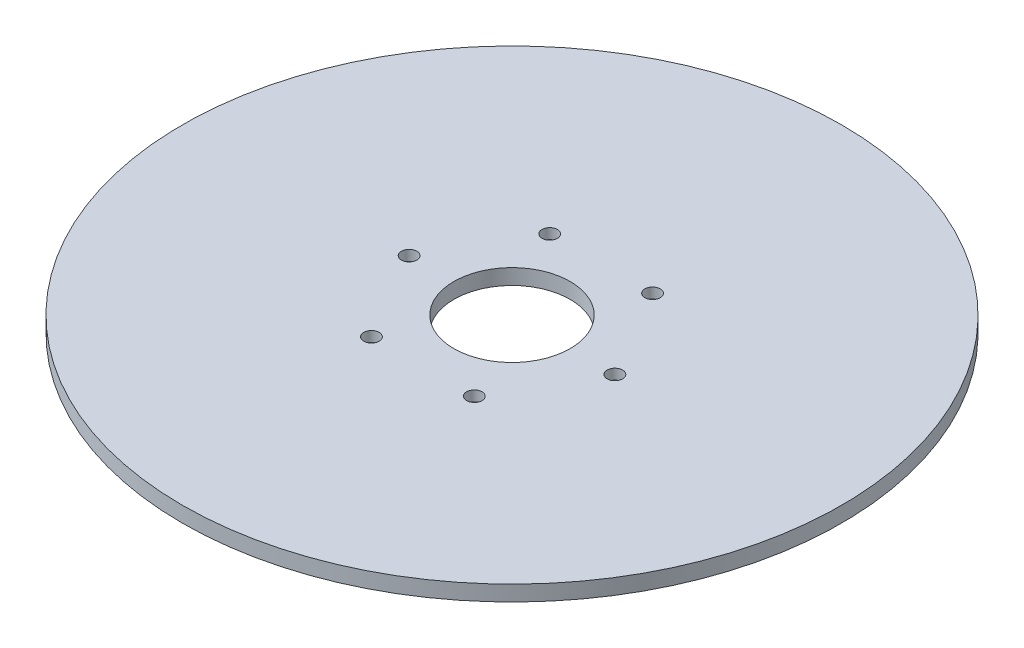
ISO-10303-21;
HEADER;
FILE_DESCRIPTION(('STEP AP214'),'2;1');
FILE_NAME('part.step','',(''),(''),'','','');
FILE_SCHEMA(('AUTOMOTIVE_DESIGN { 1 0 10303 214 1 1 1 1 }'));
ENDSEC;
DATA;
#1=APPLICATION_CONTEXT('core data for automotive mechanical design processes');
#2=APPLICATION_PROTOCOL_DEFINITION('international standard','automotive_design',2000,#1);
#3=PRODUCT_CONTEXT('',#1,'mechanical');
#4=PRODUCT('Part','Part','',(#3));
#5=PRODUCT_RELATED_PRODUCT_CATEGORY('part','',(#4));
#6=PRODUCT_DEFINITION_FORMATION('','',#4);
#7=PRODUCT_DEFINITION_CONTEXT('part definition',#1,'design');
#8=PRODUCT_DEFINITION('design','',#6,#7);
#9=PRODUCT_DEFINITION_SHAPE('','',#8);
#10=(LENGTH_UNIT() NAMED_UNIT(*) SI_UNIT(.MILLI.,.METRE.));
#11=(NAMED_UNIT(*) PLANE_ANGLE_UNIT() SI_UNIT($,.RADIAN.));
#12=(NAMED_UNIT(*) SI_UNIT($,.STERADIAN.) SOLID_ANGLE_UNIT());
#13=UNCERTAINTY_MEASURE_WITH_UNIT(LENGTH_MEASURE(1.E-05),#10,'distance_accuracy_value','');
#14=(GEOMETRIC_REPRESENTATION_CONTEXT(3) GLOBAL_UNCERTAINTY_ASSIGNED_CONTEXT((#13)) GLOBAL_UNIT_ASSIGNED_CONTEXT((#10,
#11,#12)) REPRESENTATION_CONTEXT('',''));
#15=CARTESIAN_POINT('',(0.,0.,0.));
#16=DIRECTION('',(0.,0.,1.));
#17=DIRECTION('',(1.,0.,0.));
#18=AXIS2_PLACEMENT_3D('',#15,#16,#17);
#19=CARTESIAN_POINT('',(0.,4.,0.));
#20=DIRECTION('',(0.,-1.,0.));
#21=DIRECTION('',(0.,0.,-1.));
#22=AXIS2_PLACEMENT_3D('',#19,#20,#21);
#23=CYLINDRICAL_SURFACE('',#22,85.);
#24=CARTESIAN_POINT('',(0.,4.,0.));
#25=DIRECTION('',(0.,1.,0.));
#26=DIRECTION('',(0.,0.,1.));
#27=AXIS2_PLACEMENT_3D('',#24,#25,#26);
#28=CIRCLE('',#27,85.);
#29=CARTESIAN_POINT('',(0.,4.,85.));
#30=VERTEX_POINT('',#29);
#31=EDGE_CURVE('E10',#30,#30,#28,.T.);
#32=ORIENTED_EDGE('',*,*,#31,.F.);
#33=EDGE_LOOP('',(#32));
#34=FACE_BOUND('',#33,.T.);
#35=CARTESIAN_POINT('',(0.,0.,0.));
#36=DIRECTION('',(0.,1.,0.));
#37=DIRECTION('',(0.,0.,1.));
#38=AXIS2_PLACEMENT_3D('',#35,#36,#37);
#39=CIRCLE('',#38,85.);
#40=CARTESIAN_POINT('',(0.,0.,85.));
#41=VERTEX_POINT('',#40);
#42=EDGE_CURVE('E37',#41,#41,#39,.T.);
#43=ORIENTED_EDGE('',*,*,#42,.T.);
#44=EDGE_LOOP('',(#43));
#45=FACE_BOUND('',#44,.T.);
#46=ADVANCED_FACE('F40',(#34,#45),#23,.T.);
#47=CARTESIAN_POINT('',(0.,4.,0.));
#48=DIRECTION('',(0.,1.,0.));
#49=DIRECTION('',(0.,0.,1.));
#50=AXIS2_PLACEMENT_3D('',#47,#48,#49);
#51=PLANE('',#50);
#52=CARTESIAN_POINT('',(-13.2699648840736,4.,-22.9842533938697));
#53=DIRECTION('',(0.,1.,0.));
#54=DIRECTION('',(-0.866025403784433,0.,0.50000000000001));
#55=AXIS2_PLACEMENT_3D('',#52,#53,#54);
#56=CIRCLE('',#55,1.98748782424034);
#57=CARTESIAN_POINT('',(-14.991179829578,4.,-21.9905094817495));
#58=VERTEX_POINT('',#57);
#59=EDGE_CURVE('E70',#58,#58,#56,.T.);
#60=ORIENTED_EDGE('',*,*,#59,.F.);
#61=EDGE_LOOP('',(#60));
#62=FACE_BOUND('',#61,.T.);
#63=CARTESIAN_POINT('',(13.2699648840731,4.,-22.98425339387));
#64=DIRECTION('',(0.,1.,0.));
#65=DIRECTION('',(-0.866025403784443,0.,-0.499999999999992));
#66=AXIS2_PLACEMENT_3D('',#63,#64,#65);
#67=CIRCLE('',#66,1.98748782424034);
#68=CARTESIAN_POINT('',(11.5487499385687,4.,-23.9779973059901));
#69=VERTEX_POINT('',#68);
#70=EDGE_CURVE('E71',#69,#69,#67,.T.);
#71=ORIENTED_EDGE('',*,*,#70,.F.);
#72=EDGE_LOOP('',(#71));
#73=FACE_BOUND('',#72,.T.);
#74=CARTESIAN_POINT('',(26.5399297681467,4.,0.));
#75=DIRECTION('',(0.,1.,0.));
#76=DIRECTION('',(0.,0.,-1.));
#77=AXIS2_PLACEMENT_3D('',#74,#75,#76);
#78=CIRCLE('',#77,1.98748782424034);
#79=CARTESIAN_POINT('',(26.5399297681467,4.,-1.98748782424034));
#80=VERTEX_POINT('',#79);
#81=EDGE_CURVE('E78',#80,#80,#78,.T.);
#82=ORIENTED_EDGE('',*,*,#81,.F.);
#83=EDGE_LOOP('',(#82));
#84=FACE_BOUND('',#83,.T.);
#85=CARTESIAN_POINT('',(13.2699648840734,4.,22.9842533938698));
#86=DIRECTION('',(0.,1.,0.));
#87=DIRECTION('',(0.866025403784436,0.,-0.500000000000004));
#88=AXIS2_PLACEMENT_3D('',#85,#86,#87);
#89=CIRCLE('',#88,1.98748782424034);
#90=CARTESIAN_POINT('',(14.9911798295778,4.,21.9905094817496));
#91=VERTEX_POINT('',#90);
#92=EDGE_CURVE('E84',#91,#91,#89,.T.);
#93=ORIENTED_EDGE('',*,*,#92,.F.);
#94=EDGE_LOOP('',(#93));
#95=FACE_BOUND('',#94,.T.);
#96=CARTESIAN_POINT('',(-13.2699648840733,4.,22.9842533938699));
#97=DIRECTION('',(0.,1.,0.));
#98=DIRECTION('',(0.86602540378444,0.,0.499999999999998));
#99=AXIS2_PLACEMENT_3D('',#96,#97,#98);
#100=CIRCLE('',#99,1.98748782424034);
#101=CARTESIAN_POINT('',(-11.5487499385689,4.,23.9779973059901));
#102=VERTEX_POINT('',#101);
#103=EDGE_CURVE('E61',#102,#102,#100,.T.);
#104=ORIENTED_EDGE('',*,*,#103,.F.);
#105=EDGE_LOOP('',(#104));
#106=FACE_BOUND('',#105,.T.);
#107=CARTESIAN_POINT('',(-26.5399297681467,4.,0.));
#108=DIRECTION('',(0.,1.,0.));
#109=DIRECTION('',(0.,0.,1.));
#110=AXIS2_PLACEMENT_3D('',#107,#108,#109);
#111=CIRCLE('',#110,1.98748782424034);
#112=CARTESIAN_POINT('',(-26.5399297681467,4.,1.98748782424034));
#113=VERTEX_POINT('',#112);
#114=EDGE_CURVE('E54',#113,#113,#111,.T.);
#115=ORIENTED_EDGE('',*,*,#114,.F.);
#116=EDGE_LOOP('',(#115));
#117=FACE_BOUND('',#116,.T.);
#118=CARTESIAN_POINT('',(0.,4.,0.));
#119=DIRECTION('',(0.,1.,0.));
#120=DIRECTION('',(0.,0.,1.));
#121=AXIS2_PLACEMENT_3D('',#118,#119,#120);
#122=CIRCLE('',#121,15.);
#123=CARTESIAN_POINT('',(0.,4.,15.));
#124=VERTEX_POINT('',#123);
#125=EDGE_CURVE('E50',#124,#124,#122,.T.);
#126=ORIENTED_EDGE('',*,*,#125,.F.);
#127=EDGE_LOOP('',(#126));
#128=FACE_BOUND('',#127,.T.);
#129=ORIENTED_EDGE('',*,*,#31,.T.);
#130=EDGE_LOOP('',(#129));
#131=FACE_BOUND('',#130,.T.);
#132=ADVANCED_FACE('F99',(#62,#73,#84,#95,#106,#117,#128,#131),#51,.T.);
#133=CARTESIAN_POINT('',(0.,0.,0.));
#134=DIRECTION('',(0.,1.,0.));
#135=DIRECTION('',(0.,0.,1.));
#136=AXIS2_PLACEMENT_3D('',#133,#134,#135);
#137=PLANE('',#136);
#138=CARTESIAN_POINT('',(0.,0.,0.));
#139=DIRECTION('',(0.,1.,0.));
#140=DIRECTION('',(0.,0.,1.));
#141=AXIS2_PLACEMENT_3D('',#138,#139,#140);
#142=CIRCLE('',#141,15.);
#143=CARTESIAN_POINT('',(0.,0.,15.));
#144=VERTEX_POINT('',#143);
#145=EDGE_CURVE('E47',#144,#144,#142,.T.);
#146=ORIENTED_EDGE('',*,*,#145,.T.);
#147=EDGE_LOOP('',(#146));
#148=FACE_BOUND('',#147,.T.);
#149=ORIENTED_EDGE('',*,*,#42,.F.);
#150=EDGE_LOOP('',(#149));
#151=FACE_BOUND('',#150,.T.);
#152=ADVANCED_FACE('F103',(#148,#151),#137,.F.);
#153=CARTESIAN_POINT('',(0.,4.,0.));
#154=DIRECTION('',(0.,-1.,0.));
#155=DIRECTION('',(0.,0.,-1.));
#156=AXIS2_PLACEMENT_3D('',#153,#154,#155);
#157=CYLINDRICAL_SURFACE('',#156,15.);
#158=ORIENTED_EDGE('',*,*,#125,.T.);
#159=EDGE_LOOP('',(#158));
#160=FACE_BOUND('',#159,.T.);
#161=ORIENTED_EDGE('',*,*,#145,.F.);
#162=EDGE_LOOP('',(#161));
#163=FACE_BOUND('',#162,.T.);
#164=ADVANCED_FACE('F115',(#160,#163),#157,.F.);
#165=CARTESIAN_POINT('',(-26.5399297681467,1.32239598284608,0.));
#166=DIRECTION('',(0.,1.,0.));
#167=DIRECTION('',(0.,0.,1.));
#168=AXIS2_PLACEMENT_3D('',#165,#166,#167);
#169=CYLINDRICAL_SURFACE('',#168,1.98748782424034);
#170=CARTESIAN_POINT('',(-26.5399297681467,1.32239598284608,0.));
#171=DIRECTION('',(0.,1.,0.));
#172=DIRECTION('',(0.,0.,1.));
#173=AXIS2_PLACEMENT_3D('',#170,#171,#172);
#174=CIRCLE('',#173,1.98748782424034);
#175=CARTESIAN_POINT('',(-26.5399297681467,1.32239598284608,1.98748782424034));
#176=VERTEX_POINT('',#175);
#177=EDGE_CURVE('E55',#176,#176,#174,.T.);
#178=ORIENTED_EDGE('',*,*,#177,.F.);
#179=EDGE_LOOP('',(#178));
#180=FACE_BOUND('',#179,.T.);
#181=ORIENTED_EDGE('',*,*,#114,.T.);
#182=EDGE_LOOP('',(#181));
#183=FACE_BOUND('',#182,.T.);
#184=ADVANCED_FACE('F113',(#180,#183),#169,.F.);
#185=CARTESIAN_POINT('',(-26.5399297681467,1.32239598284608,0.));
#186=DIRECTION('',(0.,1.,0.));
#187=DIRECTION('',(0.,0.,1.));
#188=AXIS2_PLACEMENT_3D('',#185,#186,#187);
#189=PLANE('',#188);
#190=ORIENTED_EDGE('',*,*,#177,.T.);
#191=EDGE_LOOP('',(#190));
#192=FACE_BOUND('',#191,.T.);
#193=ADVANCED_FACE('F144',(#192),#189,.T.);
#194=CARTESIAN_POINT('',(-13.2699648840733,1.32239598284608,22.9842533938699));
#195=DIRECTION('',(0.,1.,0.));
#196=DIRECTION('',(0.,0.,1.));
#197=AXIS2_PLACEMENT_3D('',#194,#195,#196);
#198=CYLINDRICAL_SURFACE('',#197,1.98748782424034);
#199=CARTESIAN_POINT('',(-13.2699648840733,1.32239598284608,22.9842533938699));
#200=DIRECTION('',(0.,1.,0.));
#201=DIRECTION('',(0.86602540378444,0.,0.499999999999998));
#202=AXIS2_PLACEMENT_3D('',#199,#200,#201);
#203=CIRCLE('',#202,1.98748782424034);
#204=CARTESIAN_POINT('',(-11.5487499385689,1.32239598284608,23.9779973059901));
#205=VERTEX_POINT('',#204);
#206=EDGE_CURVE('E59',#205,#205,#203,.T.);
#207=ORIENTED_EDGE('',*,*,#206,.F.);
#208=EDGE_LOOP('',(#207));
#209=FACE_BOUND('',#208,.T.);
#210=ORIENTED_EDGE('',*,*,#103,.T.);
#211=EDGE_LOOP('',(#210));
#212=FACE_BOUND('',#211,.T.);
#213=ADVANCED_FACE('F153',(#209,#212),#198,.F.);
#214=CARTESIAN_POINT('',(-13.2699648840733,1.32239598284608,22.9842533938699));
#215=DIRECTION('',(0.,1.,0.));
#216=DIRECTION('',(0.86602540378444,0.,0.499999999999998));
#217=AXIS2_PLACEMENT_3D('',#214,#215,#216);
#218=PLANE('',#217);
#219=ORIENTED_EDGE('',*,*,#206,.T.);
#220=EDGE_LOOP('',(#219));
#221=FACE_BOUND('',#220,.T.);
#222=ADVANCED_FACE('F96',(#221),#218,.T.);
#223=CARTESIAN_POINT('',(13.2699648840734,1.32239598284608,22.9842533938698));
#224=DIRECTION('',(0.,1.,0.));
#225=DIRECTION('',(0.,0.,1.));
#226=AXIS2_PLACEMENT_3D('',#223,#224,#225);
#227=CYLINDRICAL_SURFACE('',#226,1.98748782424034);
#228=CARTESIAN_POINT('',(13.2699648840734,1.32239598284608,22.9842533938698));
#229=DIRECTION('',(0.,1.,0.));
#230=DIRECTION('',(0.866025403784436,0.,-0.500000000000004));
#231=AXIS2_PLACEMENT_3D('',#228,#229,#230);
#232=CIRCLE('',#231,1.98748782424034);
#233=CARTESIAN_POINT('',(14.9911798295778,1.32239598284608,21.9905094817496));
#234=VERTEX_POINT('',#233);
#235=EDGE_CURVE('E63',#234,#234,#232,.T.);
#236=ORIENTED_EDGE('',*,*,#235,.F.);
#237=EDGE_LOOP('',(#236));
#238=FACE_BOUND('',#237,.T.);
#239=ORIENTED_EDGE('',*,*,#92,.T.);
#240=EDGE_LOOP('',(#239));
#241=FACE_BOUND('',#240,.T.);
#242=ADVANCED_FACE('F91',(#238,#241),#227,.F.);
#243=CARTESIAN_POINT('',(13.2699648840734,1.32239598284608,22.9842533938698));
#244=DIRECTION('',(0.,1.,0.));
#245=DIRECTION('',(0.866025403784436,0.,-0.500000000000004));
#246=AXIS2_PLACEMENT_3D('',#243,#244,#245);
#247=PLANE('',#246);
#248=ORIENTED_EDGE('',*,*,#235,.T.);
#249=EDGE_LOOP('',(#248));
#250=FACE_BOUND('',#249,.T.);
#251=ADVANCED_FACE('F93',(#250),#247,.T.);
#252=CARTESIAN_POINT('',(26.5399297681467,1.32239598284608,0.));
#253=DIRECTION('',(0.,1.,0.));
#254=DIRECTION('',(0.,0.,1.));
#255=AXIS2_PLACEMENT_3D('',#252,#253,#254);
#256=CYLINDRICAL_SURFACE('',#255,1.98748782424034);
#257=CARTESIAN_POINT('',(26.5399297681467,1.32239598284608,0.));
#258=DIRECTION('',(0.,1.,0.));
#259=DIRECTION('',(0.,0.,-1.));
#260=AXIS2_PLACEMENT_3D('',#257,#258,#259);
#261=CIRCLE('',#260,1.98748782424034);
#262=CARTESIAN_POINT('',(26.5399297681467,1.32239598284608,-1.98748782424034));
#263=VERTEX_POINT('',#262);
#264=EDGE_CURVE('E85',#263,#263,#261,.T.);
#265=ORIENTED_EDGE('',*,*,#264,.F.);
#266=EDGE_LOOP('',(#265));
#267=FACE_BOUND('',#266,.T.);
#268=ORIENTED_EDGE('',*,*,#81,.T.);
#269=EDGE_LOOP('',(#268));
#270=FACE_BOUND('',#269,.T.);
#271=ADVANCED_FACE('F187',(#267,#270),#256,.F.);
#272=CARTESIAN_POINT('',(26.5399297681467,1.32239598284608,0.));
#273=DIRECTION('',(0.,1.,0.));
#274=DIRECTION('',(0.,0.,-1.));
#275=AXIS2_PLACEMENT_3D('',#272,#273,#274);
#276=PLANE('',#275);
#277=ORIENTED_EDGE('',*,*,#264,.T.);
#278=EDGE_LOOP('',(#277));
#279=FACE_BOUND('',#278,.T.);
#280=ADVANCED_FACE('F198',(#279),#276,.T.);
#281=CARTESIAN_POINT('',(13.2699648840731,1.32239598284608,-22.98425339387));
#282=DIRECTION('',(0.,1.,0.));
#283=DIRECTION('',(0.,0.,1.));
#284=AXIS2_PLACEMENT_3D('',#281,#282,#283);
#285=CYLINDRICAL_SURFACE('',#284,1.98748782424034);
#286=CARTESIAN_POINT('',(13.2699648840731,1.32239598284608,-22.98425339387));
#287=DIRECTION('',(0.,1.,0.));
#288=DIRECTION('',(-0.866025403784443,0.,-0.499999999999992));
#289=AXIS2_PLACEMENT_3D('',#286,#287,#288);
#290=CIRCLE('',#289,1.98748782424034);
#291=CARTESIAN_POINT('',(11.5487499385687,1.32239598284608,-23.9779973059901));
#292=VERTEX_POINT('',#291);
#293=EDGE_CURVE('E76',#292,#292,#290,.T.);
#294=ORIENTED_EDGE('',*,*,#293,.F.);
#295=EDGE_LOOP('',(#294));
#296=FACE_BOUND('',#295,.T.);
#297=ORIENTED_EDGE('',*,*,#70,.T.);
#298=EDGE_LOOP('',(#297));
#299=FACE_BOUND('',#298,.T.);
#300=ADVANCED_FACE('F202',(#296,#299),#285,.F.);
#301=CARTESIAN_POINT('',(13.2699648840731,1.32239598284608,-22.98425339387));
#302=DIRECTION('',(0.,1.,0.));
#303=DIRECTION('',(-0.866025403784443,0.,-0.499999999999992));
#304=AXIS2_PLACEMENT_3D('',#301,#302,#303);
#305=PLANE('',#304);
#306=ORIENTED_EDGE('',*,*,#293,.T.);
#307=EDGE_LOOP('',(#306));
#308=FACE_BOUND('',#307,.T.);
#309=ADVANCED_FACE('F212',(#308),#305,.T.);
#310=CARTESIAN_POINT('',(-13.2699648840736,1.32239598284608,-22.9842533938697));
#311=DIRECTION('',(0.,1.,0.));
#312=DIRECTION('',(0.,0.,1.));
#313=AXIS2_PLACEMENT_3D('',#310,#311,#312);
#314=CYLINDRICAL_SURFACE('',#313,1.98748782424034);
#315=CARTESIAN_POINT('',(-13.2699648840736,1.32239598284608,-22.9842533938697));
#316=DIRECTION('',(0.,1.,0.));
#317=DIRECTION('',(-0.866025403784433,0.,0.50000000000001));
#318=AXIS2_PLACEMENT_3D('',#315,#316,#317);
#319=CIRCLE('',#318,1.98748782424034);
#320=CARTESIAN_POINT('',(-14.991179829578,1.32239598284608,-21.9905094817495));
#321=VERTEX_POINT('',#320);
#322=EDGE_CURVE('E69',#321,#321,#319,.T.);
#323=ORIENTED_EDGE('',*,*,#322,.F.);
#324=EDGE_LOOP('',(#323));
#325=FACE_BOUND('',#324,.T.);
#326=ORIENTED_EDGE('',*,*,#59,.T.);
#327=EDGE_LOOP('',(#326));
#328=FACE_BOUND('',#327,.T.);
#329=ADVANCED_FACE('F224',(#325,#328),#314,.F.);
#330=CARTESIAN_POINT('',(-13.2699648840736,1.32239598284608,-22.9842533938697));
#331=DIRECTION('',(0.,1.,0.));
#332=DIRECTION('',(-0.866025403784433,0.,0.50000000000001));
#333=AXIS2_PLACEMENT_3D('',#330,#331,#332);
#334=PLANE('',#333);
#335=ORIENTED_EDGE('',*,*,#322,.T.);
#336=EDGE_LOOP('',(#335));
#337=FACE_BOUND('',#336,.T.);
#338=ADVANCED_FACE('F235',(#337),#334,.T.);
#339=CLOSED_SHELL('',(#46,#132,#152,#164,#184,#193,#213,#222,#242,#251,#271,#280,#300,#309,#329,#338));
#340=MANIFOLD_SOLID_BREP('B2',#339);
#341=ADVANCED_BREP_SHAPE_REPRESENTATION('',(#18,#340),#14);
#342=SHAPE_DEFINITION_REPRESENTATION(#9,#341);
ENDSEC;
END-ISO-10303-21;
